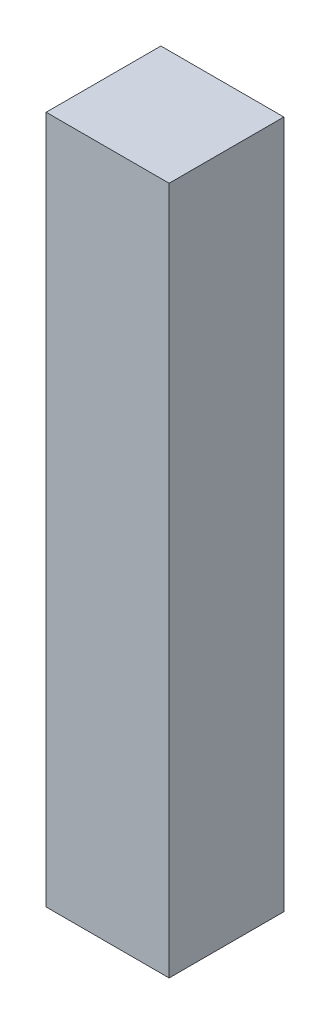
ISO-10303-21;
HEADER;
FILE_DESCRIPTION(('STEP AP214'),'2;1');
FILE_NAME('part.step','',(''),(''),'','','');
FILE_SCHEMA(('AUTOMOTIVE_DESIGN { 1 0 10303 214 1 1 1 1 }'));
ENDSEC;
DATA;
#1=APPLICATION_CONTEXT('core data for automotive mechanical design processes');
#2=APPLICATION_PROTOCOL_DEFINITION('international standard','automotive_design',2000,#1);
#3=PRODUCT_CONTEXT('',#1,'mechanical');
#4=PRODUCT('Part','Part','',(#3));
#5=PRODUCT_RELATED_PRODUCT_CATEGORY('part','',(#4));
#6=PRODUCT_DEFINITION_FORMATION('','',#4);
#7=PRODUCT_DEFINITION_CONTEXT('part definition',#1,'design');
#8=PRODUCT_DEFINITION('design','',#6,#7);
#9=PRODUCT_DEFINITION_SHAPE('','',#8);
#10=(LENGTH_UNIT() NAMED_UNIT(*) SI_UNIT(.MILLI.,.METRE.));
#11=(NAMED_UNIT(*) PLANE_ANGLE_UNIT() SI_UNIT($,.RADIAN.));
#12=(NAMED_UNIT(*) SI_UNIT($,.STERADIAN.) SOLID_ANGLE_UNIT());
#13=UNCERTAINTY_MEASURE_WITH_UNIT(LENGTH_MEASURE(1.E-05),#10,'distance_accuracy_value','');
#14=(GEOMETRIC_REPRESENTATION_CONTEXT(3) GLOBAL_UNCERTAINTY_ASSIGNED_CONTEXT((#13)) GLOBAL_UNIT_ASSIGNED_CONTEXT((#10,
#11,#12)) REPRESENTATION_CONTEXT('',''));
#15=CARTESIAN_POINT('',(0.,0.,0.));
#16=DIRECTION('',(0.,0.,1.));
#17=DIRECTION('',(1.,0.,0.));
#18=AXIS2_PLACEMENT_3D('',#15,#16,#17);
#19=CARTESIAN_POINT('',(0.,0.,3.175));
#20=DIRECTION('',(1.,0.,0.));
#21=DIRECTION('',(0.,1.,0.));
#22=AXIS2_PLACEMENT_3D('',#19,#20,#21);
#23=PLANE('',#22);
#24=DIRECTION('',(0.,-1.,0.));
#25=VECTOR('',#24,1.);
#26=CARTESIAN_POINT('',(0.,0.,0.));
#27=LINE('',#26,#25);
#28=CARTESIAN_POINT('',(0.,0.,0.));
#29=VERTEX_POINT('',#28);
#30=CARTESIAN_POINT('',(0.,-19.05,0.));
#31=VERTEX_POINT('',#30);
#32=EDGE_CURVE('E96',#29,#31,#27,.T.);
#33=ORIENTED_EDGE('',*,*,#32,.T.);
#34=DIRECTION('',(0.,0.,-1.));
#35=VECTOR('',#34,1.);
#36=CARTESIAN_POINT('',(0.,-19.05,3.175));
#37=LINE('',#36,#35);
#38=CARTESIAN_POINT('',(0.,-19.05,3.175));
#39=VERTEX_POINT('',#38);
#40=EDGE_CURVE('E11',#39,#31,#37,.T.);
#41=ORIENTED_EDGE('',*,*,#40,.F.);
#42=DIRECTION('',(0.,-1.,0.));
#43=VECTOR('',#42,1.);
#44=CARTESIAN_POINT('',(0.,0.,3.175));
#45=LINE('',#44,#43);
#46=CARTESIAN_POINT('',(0.,0.,3.175));
#47=VERTEX_POINT('',#46);
#48=EDGE_CURVE('E84',#47,#39,#45,.T.);
#49=ORIENTED_EDGE('',*,*,#48,.F.);
#50=DIRECTION('',(0.,0.,-1.));
#51=VECTOR('',#50,1.);
#52=CARTESIAN_POINT('',(0.,0.,3.175));
#53=LINE('',#52,#51);
#54=EDGE_CURVE('E92',#47,#29,#53,.T.);
#55=ORIENTED_EDGE('',*,*,#54,.T.);
#56=EDGE_LOOP('',(#33,#41,#49,#55));
#57=FACE_BOUND('',#56,.T.);
#58=ADVANCED_FACE('F33',(#57),#23,.F.);
#59=CARTESIAN_POINT('',(0.,-19.05,3.175));
#60=DIRECTION('',(0.,1.,0.));
#61=DIRECTION('',(0.,0.,1.));
#62=AXIS2_PLACEMENT_3D('',#59,#60,#61);
#63=PLANE('',#62);
#64=DIRECTION('',(1.,0.,0.));
#65=VECTOR('',#64,1.);
#66=CARTESIAN_POINT('',(0.,-19.05,0.));
#67=LINE('',#66,#65);
#68=CARTESIAN_POINT('',(3.4036,-19.05,0.));
#69=VERTEX_POINT('',#68);
#70=EDGE_CURVE('E88',#31,#69,#67,.T.);
#71=ORIENTED_EDGE('',*,*,#70,.T.);
#72=DIRECTION('',(0.,0.,-1.));
#73=VECTOR('',#72,1.);
#74=CARTESIAN_POINT('',(3.4036,-19.05,3.175));
#75=LINE('',#74,#73);
#76=CARTESIAN_POINT('',(3.4036,-19.05,3.175));
#77=VERTEX_POINT('',#76);
#78=EDGE_CURVE('E41',#77,#69,#75,.T.);
#79=ORIENTED_EDGE('',*,*,#78,.F.);
#80=DIRECTION('',(1.,0.,0.));
#81=VECTOR('',#80,1.);
#82=CARTESIAN_POINT('',(0.,-19.05,3.175));
#83=LINE('',#82,#81);
#84=EDGE_CURVE('E79',#39,#77,#83,.T.);
#85=ORIENTED_EDGE('',*,*,#84,.F.);
#86=ORIENTED_EDGE('',*,*,#40,.T.);
#87=EDGE_LOOP('',(#71,#79,#85,#86));
#88=FACE_BOUND('',#87,.T.);
#89=ADVANCED_FACE('F87',(#88),#63,.F.);
#90=CARTESIAN_POINT('',(3.4036,0.,3.175));
#91=DIRECTION('',(-1.,0.,0.));
#92=DIRECTION('',(0.,-1.,0.));
#93=AXIS2_PLACEMENT_3D('',#90,#91,#92);
#94=PLANE('',#93);
#95=DIRECTION('',(0.,1.,0.));
#96=VECTOR('',#95,1.);
#97=CARTESIAN_POINT('',(3.4036,0.,0.));
#98=LINE('',#97,#96);
#99=CARTESIAN_POINT('',(3.4036,0.,0.));
#100=VERTEX_POINT('',#99);
#101=EDGE_CURVE('E66',#69,#100,#98,.T.);
#102=ORIENTED_EDGE('',*,*,#101,.T.);
#103=DIRECTION('',(0.,0.,-1.));
#104=VECTOR('',#103,1.);
#105=CARTESIAN_POINT('',(3.4036,0.,3.175));
#106=LINE('',#105,#104);
#107=CARTESIAN_POINT('',(3.4036,0.,3.175));
#108=VERTEX_POINT('',#107);
#109=EDGE_CURVE('E89',#108,#100,#106,.T.);
#110=ORIENTED_EDGE('',*,*,#109,.F.);
#111=DIRECTION('',(0.,1.,0.));
#112=VECTOR('',#111,1.);
#113=CARTESIAN_POINT('',(3.4036,0.,3.175));
#114=LINE('',#113,#112);
#115=EDGE_CURVE('E82',#77,#108,#114,.T.);
#116=ORIENTED_EDGE('',*,*,#115,.F.);
#117=ORIENTED_EDGE('',*,*,#78,.T.);
#118=EDGE_LOOP('',(#102,#110,#116,#117));
#119=FACE_BOUND('',#118,.T.);
#120=ADVANCED_FACE('F90',(#119),#94,.F.);
#121=CARTESIAN_POINT('',(0.,0.,3.175));
#122=DIRECTION('',(0.,-1.,0.));
#123=DIRECTION('',(0.,0.,-1.));
#124=AXIS2_PLACEMENT_3D('',#121,#122,#123);
#125=PLANE('',#124);
#126=DIRECTION('',(-1.,0.,0.));
#127=VECTOR('',#126,1.);
#128=CARTESIAN_POINT('',(0.,0.,0.));
#129=LINE('',#128,#127);
#130=EDGE_CURVE('E72',#100,#29,#129,.T.);
#131=ORIENTED_EDGE('',*,*,#130,.T.);
#132=ORIENTED_EDGE('',*,*,#54,.F.);
#133=DIRECTION('',(-1.,0.,0.));
#134=VECTOR('',#133,1.);
#135=CARTESIAN_POINT('',(0.,0.,3.175));
#136=LINE('',#135,#134);
#137=EDGE_CURVE('E49',#108,#47,#136,.T.);
#138=ORIENTED_EDGE('',*,*,#137,.F.);
#139=ORIENTED_EDGE('',*,*,#109,.T.);
#140=EDGE_LOOP('',(#131,#132,#138,#139));
#141=FACE_BOUND('',#140,.T.);
#142=ADVANCED_FACE('F103',(#141),#125,.F.);
#143=CARTESIAN_POINT('',(0.,0.,3.175));
#144=DIRECTION('',(0.,0.,1.));
#145=DIRECTION('',(1.,0.,0.));
#146=AXIS2_PLACEMENT_3D('',#143,#144,#145);
#147=PLANE('',#146);
#148=ORIENTED_EDGE('',*,*,#48,.T.);
#149=ORIENTED_EDGE('',*,*,#84,.T.);
#150=ORIENTED_EDGE('',*,*,#115,.T.);
#151=ORIENTED_EDGE('',*,*,#137,.T.);
#152=EDGE_LOOP('',(#148,#149,#150,#151));
#153=FACE_BOUND('',#152,.T.);
#154=ADVANCED_FACE('F80',(#153),#147,.T.);
#155=CARTESIAN_POINT('',(0.,0.,0.));
#156=DIRECTION('',(0.,0.,1.));
#157=DIRECTION('',(1.,0.,0.));
#158=AXIS2_PLACEMENT_3D('',#155,#156,#157);
#159=PLANE('',#158);
#160=ORIENTED_EDGE('',*,*,#32,.F.);
#161=ORIENTED_EDGE('',*,*,#130,.F.);
#162=ORIENTED_EDGE('',*,*,#101,.F.);
#163=ORIENTED_EDGE('',*,*,#70,.F.);
#164=EDGE_LOOP('',(#160,#161,#162,#163));
#165=FACE_BOUND('',#164,.T.);
#166=ADVANCED_FACE('F106',(#165),#159,.F.);
#167=CLOSED_SHELL('',(#58,#89,#120,#142,#154,#166));
#168=MANIFOLD_SOLID_BREP('B2',#167);
#169=ADVANCED_BREP_SHAPE_REPRESENTATION('',(#18,#168),#14);
#170=SHAPE_DEFINITION_REPRESENTATION(#9,#169);
ENDSEC;
END-ISO-10303-21;
